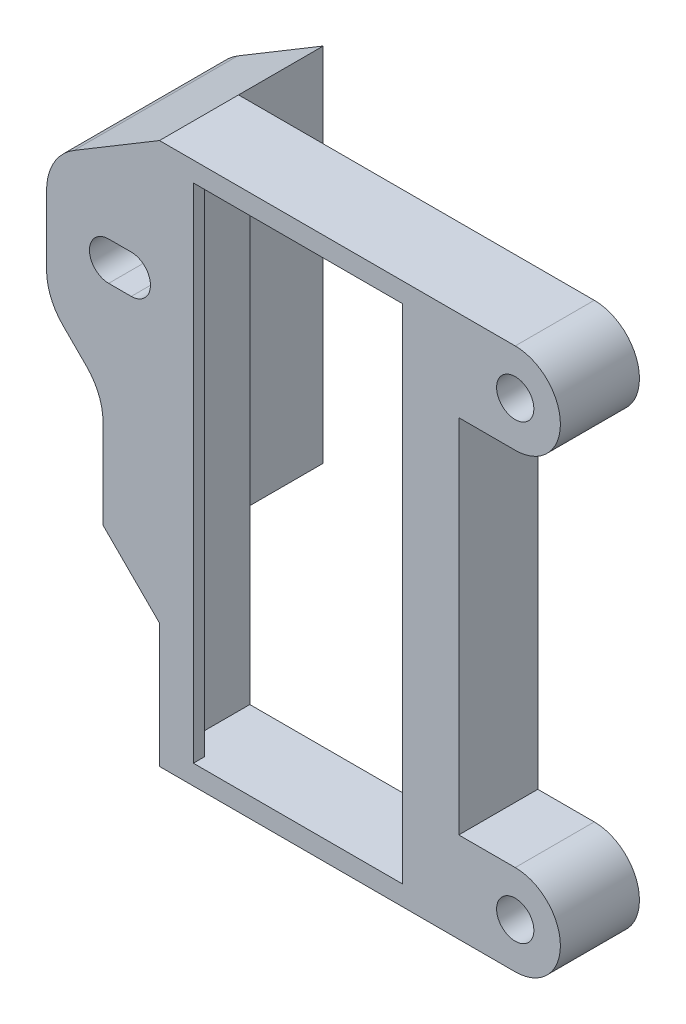
ISO-10303-21;
HEADER;
FILE_DESCRIPTION(('STEP AP214'),'2;1');
FILE_NAME('part.step','',(''),(''),'','','');
FILE_SCHEMA(('AUTOMOTIVE_DESIGN { 1 0 10303 214 1 1 1 1 }'));
ENDSEC;
DATA;
#1=APPLICATION_CONTEXT('core data for automotive mechanical design processes');
#2=APPLICATION_PROTOCOL_DEFINITION('international standard','automotive_design',2000,#1);
#3=PRODUCT_CONTEXT('',#1,'mechanical');
#4=PRODUCT('Part','Part','',(#3));
#5=PRODUCT_RELATED_PRODUCT_CATEGORY('part','',(#4));
#6=PRODUCT_DEFINITION_FORMATION('','',#4);
#7=PRODUCT_DEFINITION_CONTEXT('part definition',#1,'design');
#8=PRODUCT_DEFINITION('design','',#6,#7);
#9=PRODUCT_DEFINITION_SHAPE('','',#8);
#10=(LENGTH_UNIT() NAMED_UNIT(*) SI_UNIT(.MILLI.,.METRE.));
#11=(NAMED_UNIT(*) PLANE_ANGLE_UNIT() SI_UNIT($,.RADIAN.));
#12=(NAMED_UNIT(*) SI_UNIT($,.STERADIAN.) SOLID_ANGLE_UNIT());
#13=UNCERTAINTY_MEASURE_WITH_UNIT(LENGTH_MEASURE(1.E-05),#10,'distance_accuracy_value','');
#14=(GEOMETRIC_REPRESENTATION_CONTEXT(3) GLOBAL_UNCERTAINTY_ASSIGNED_CONTEXT((#13)) GLOBAL_UNIT_ASSIGNED_CONTEXT((#10,
#11,#12)) REPRESENTATION_CONTEXT('',''));
#15=CARTESIAN_POINT('',(0.,0.,0.));
#16=DIRECTION('',(0.,0.,1.));
#17=DIRECTION('',(1.,0.,0.));
#18=AXIS2_PLACEMENT_3D('',#15,#16,#17);
#19=CARTESIAN_POINT('',(-12.25,24.,1.));
#20=DIRECTION('',(1.,0.,0.));
#21=DIRECTION('',(0.,0.,-1.));
#22=AXIS2_PLACEMENT_3D('',#19,#20,#21);
#23=PLANE('',#22);
#24=DIRECTION('',(0.,-1.,0.));
#25=VECTOR('',#24,1.);
#26=CARTESIAN_POINT('',(-12.25,24.,1.));
#27=LINE('',#26,#25);
#28=CARTESIAN_POINT('',(-12.25,-13.,1.));
#29=VERTEX_POINT('',#28);
#30=CARTESIAN_POINT('',(-12.25,-24.,1.));
#31=VERTEX_POINT('',#30);
#32=EDGE_CURVE('E436',#29,#31,#27,.T.);
#33=ORIENTED_EDGE('',*,*,#32,.F.);
#34=DIRECTION('',(0.,0.,-1.));
#35=VECTOR('',#34,1.);
#36=CARTESIAN_POINT('',(-12.25,-13.,1.));
#37=LINE('',#36,#35);
#38=CARTESIAN_POINT('',(-12.25,-13.,-6.));
#39=VERTEX_POINT('',#38);
#40=EDGE_CURVE('E480',#29,#39,#37,.T.);
#41=ORIENTED_EDGE('',*,*,#40,.T.);
#42=DIRECTION('',(0.,-1.,0.));
#43=VECTOR('',#42,1.);
#44=CARTESIAN_POINT('',(-12.25,24.,-6.));
#45=LINE('',#44,#43);
#46=CARTESIAN_POINT('',(-12.25,-24.,-6.));
#47=VERTEX_POINT('',#46);
#48=EDGE_CURVE('E352',#39,#47,#45,.T.);
#49=ORIENTED_EDGE('',*,*,#48,.T.);
#50=DIRECTION('',(0.,0.,-1.));
#51=VECTOR('',#50,1.);
#52=CARTESIAN_POINT('',(-12.25,-24.,1.));
#53=LINE('',#52,#51);
#54=EDGE_CURVE('E440',#31,#47,#53,.T.);
#55=ORIENTED_EDGE('',*,*,#54,.F.);
#56=EDGE_LOOP('',(#33,#41,#49,#55));
#57=FACE_BOUND('',#56,.T.);
#58=ADVANCED_FACE('F37',(#57),#23,.F.);
#59=CARTESIAN_POINT('',(0.,0.,0.));
#60=DIRECTION('',(0.,0.,1.));
#61=DIRECTION('',(1.,0.,0.));
#62=AXIS2_PLACEMENT_3D('',#59,#60,#61);
#63=PLANE('',#62);
#64=DIRECTION('',(-1.,0.,0.));
#65=VECTOR('',#64,1.);
#66=CARTESIAN_POINT('',(0.,22.25,0.));
#67=LINE('',#66,#65);
#68=CARTESIAN_POINT('',(-9.25,22.25,0.));
#69=VERTEX_POINT('',#68);
#70=CARTESIAN_POINT('',(-11.25,22.25,0.));
#71=VERTEX_POINT('',#70);
#72=EDGE_CURVE('E405',#69,#71,#67,.T.);
#73=ORIENTED_EDGE('',*,*,#72,.F.);
#74=DIRECTION('',(0.,-1.,0.));
#75=VECTOR('',#74,1.);
#76=CARTESIAN_POINT('',(-9.25,22.25,0.));
#77=LINE('',#76,#75);
#78=CARTESIAN_POINT('',(-9.25,-22.25,0.));
#79=VERTEX_POINT('',#78);
#80=EDGE_CURVE('E412',#69,#79,#77,.T.);
#81=ORIENTED_EDGE('',*,*,#80,.T.);
#82=DIRECTION('',(1.,0.,0.));
#83=VECTOR('',#82,1.);
#84=CARTESIAN_POINT('',(0.,-22.25,0.));
#85=LINE('',#84,#83);
#86=CARTESIAN_POINT('',(-11.25,-22.25,0.));
#87=VERTEX_POINT('',#86);
#88=EDGE_CURVE('E402',#87,#79,#85,.T.);
#89=ORIENTED_EDGE('',*,*,#88,.F.);
#90=DIRECTION('',(0.,-1.,0.));
#91=VECTOR('',#90,1.);
#92=CARTESIAN_POINT('',(-11.25,0.,0.));
#93=LINE('',#92,#91);
#94=EDGE_CURVE('E449',#71,#87,#93,.T.);
#95=ORIENTED_EDGE('',*,*,#94,.F.);
#96=EDGE_LOOP('',(#73,#81,#89,#95));
#97=FACE_BOUND('',#96,.T.);
#98=ADVANCED_FACE('F545',(#97),#63,.F.);
#99=CARTESIAN_POINT('',(11.25,22.25,0.));
#100=VERTEX_POINT('',#99);
#101=CARTESIAN_POINT('',(9.25,22.25,0.));
#102=VERTEX_POINT('',#101);
#103=EDGE_CURVE('E408',#100,#102,#67,.T.);
#104=ORIENTED_EDGE('',*,*,#103,.F.);
#105=DIRECTION('',(0.,1.,0.));
#106=VECTOR('',#105,1.);
#107=CARTESIAN_POINT('',(11.25,0.,0.));
#108=LINE('',#107,#106);
#109=CARTESIAN_POINT('',(11.25,-22.25,0.));
#110=VERTEX_POINT('',#109);
#111=EDGE_CURVE('E446',#110,#100,#108,.T.);
#112=ORIENTED_EDGE('',*,*,#111,.F.);
#113=CARTESIAN_POINT('',(9.25,-22.25,0.));
#114=VERTEX_POINT('',#113);
#115=EDGE_CURVE('E391',#114,#110,#85,.T.);
#116=ORIENTED_EDGE('',*,*,#115,.F.);
#117=DIRECTION('',(0.,1.,0.));
#118=VECTOR('',#117,1.);
#119=CARTESIAN_POINT('',(9.25,22.25,0.));
#120=LINE('',#119,#118);
#121=EDGE_CURVE('E420',#114,#102,#120,.T.);
#122=ORIENTED_EDGE('',*,*,#121,.T.);
#123=EDGE_LOOP('',(#104,#112,#116,#122));
#124=FACE_BOUND('',#123,.T.);
#125=ADVANCED_FACE('F550',(#124),#63,.F.);
#126=CARTESIAN_POINT('',(0.,0.,1.));
#127=DIRECTION('',(0.,0.,1.));
#128=DIRECTION('',(1.,0.,0.));
#129=AXIS2_PLACEMENT_3D('',#126,#127,#128);
#130=PLANE('',#129);
#131=DIRECTION('',(-1.,0.,0.));
#132=VECTOR('',#131,1.);
#133=CARTESIAN_POINT('',(-9.25,22.25,1.));
#134=LINE('',#133,#132);
#135=CARTESIAN_POINT('',(9.25,22.25,1.));
#136=VERTEX_POINT('',#135);
#137=CARTESIAN_POINT('',(-9.25,22.25,1.));
#138=VERTEX_POINT('',#137);
#139=EDGE_CURVE('E411',#136,#138,#134,.T.);
#140=ORIENTED_EDGE('',*,*,#139,.F.);
#141=DIRECTION('',(0.,1.,0.));
#142=VECTOR('',#141,1.);
#143=CARTESIAN_POINT('',(9.25,22.25,1.));
#144=LINE('',#143,#142);
#145=CARTESIAN_POINT('',(9.25,-22.25,1.));
#146=VERTEX_POINT('',#145);
#147=EDGE_CURVE('E409',#146,#136,#144,.T.);
#148=ORIENTED_EDGE('',*,*,#147,.F.);
#149=DIRECTION('',(1.,0.,0.));
#150=VECTOR('',#149,1.);
#151=CARTESIAN_POINT('',(-9.25,-22.25,1.));
#152=LINE('',#151,#150);
#153=CARTESIAN_POINT('',(-9.25,-22.25,1.));
#154=VERTEX_POINT('',#153);
#155=EDGE_CURVE('E417',#154,#146,#152,.T.);
#156=ORIENTED_EDGE('',*,*,#155,.F.);
#157=DIRECTION('',(0.,-1.,0.));
#158=VECTOR('',#157,1.);
#159=CARTESIAN_POINT('',(-9.25,22.25,1.));
#160=LINE('',#159,#158);
#161=EDGE_CURVE('E414',#138,#154,#160,.T.);
#162=ORIENTED_EDGE('',*,*,#161,.F.);
#163=EDGE_LOOP('',(#140,#148,#156,#162));
#164=FACE_BOUND('',#163,.T.);
#165=DIRECTION('',(-0.857492925712544,-0.514495755427527,0.));
#166=VECTOR('',#165,1.);
#167=CARTESIAN_POINT('',(-13.8308823529412,23.0514705882353,1.));
#168=LINE('',#167,#166);
#169=CARTESIAN_POINT('',(-12.25,24.,1.));
#170=VERTEX_POINT('',#169);
#171=CARTESIAN_POINT('',(-19.8224787771376,19.4565127337174,1.));
#172=VERTEX_POINT('',#171);
#173=EDGE_CURVE('E294',#170,#172,#168,.T.);
#174=ORIENTED_EDGE('',*,*,#173,.T.);
#175=CARTESIAN_POINT('',(-17.25,15.1690481051547,1.));
#176=DIRECTION('',(0.,0.,1.));
#177=DIRECTION('',(1.,0.,0.));
#178=AXIS2_PLACEMENT_3D('',#175,#176,#177);
#179=CIRCLE('',#178,5.);
#180=CARTESIAN_POINT('',(-22.25,15.1690481051547,1.));
#181=VERTEX_POINT('',#180);
#182=EDGE_CURVE('E464',#172,#181,#179,.T.);
#183=ORIENTED_EDGE('',*,*,#182,.T.);
#184=DIRECTION('',(0.,-1.,0.));
#185=VECTOR('',#184,1.);
#186=CARTESIAN_POINT('',(-22.25,0.,1.));
#187=LINE('',#186,#185);
#188=CARTESIAN_POINT('',(-22.25,9.07106781186548,1.));
#189=VERTEX_POINT('',#188);
#190=EDGE_CURVE('E263',#181,#189,#187,.T.);
#191=ORIENTED_EDGE('',*,*,#190,.T.);
#192=CARTESIAN_POINT('',(-17.25,9.07106781186548,1.));
#193=DIRECTION('',(0.,0.,1.));
#194=DIRECTION('',(1.,0.,0.));
#195=AXIS2_PLACEMENT_3D('',#192,#193,#194);
#196=CIRCLE('',#195,5.);
#197=CARTESIAN_POINT('',(-20.7855339059327,5.53553390593274,1.));
#198=VERTEX_POINT('',#197);
#199=EDGE_CURVE('E462',#189,#198,#196,.T.);
#200=ORIENTED_EDGE('',*,*,#199,.T.);
#201=DIRECTION('',(0.707106781186548,-0.707106781186547,0.));
#202=VECTOR('',#201,1.);
#203=CARTESIAN_POINT('',(-7.62499999999997,-7.62499999999999,1.));
#204=LINE('',#203,#202);
#205=CARTESIAN_POINT('',(-18.7144660940673,3.46446609406728,1.));
#206=VERTEX_POINT('',#205);
#207=EDGE_CURVE('E260',#198,#206,#204,.T.);
#208=ORIENTED_EDGE('',*,*,#207,.T.);
#209=CARTESIAN_POINT('',(-22.25,-0.0710678118654613,1.));
#210=DIRECTION('',(0.,0.,1.));
#211=DIRECTION('',(1.,0.,0.));
#212=AXIS2_PLACEMENT_3D('',#209,#210,#211);
#213=CIRCLE('',#212,5.);
#214=CARTESIAN_POINT('',(-17.25,-0.0710678118654613,1.));
#215=VERTEX_POINT('',#214);
#216=EDGE_CURVE('E475',#206,#215,#213,.F.);
#217=ORIENTED_EDGE('',*,*,#216,.T.);
#218=DIRECTION('',(0.,-1.,0.));
#219=VECTOR('',#218,1.);
#220=CARTESIAN_POINT('',(-17.25,0.,1.));
#221=LINE('',#220,#219);
#222=CARTESIAN_POINT('',(-17.25,-8.00000000000002,1.));
#223=VERTEX_POINT('',#222);
#224=EDGE_CURVE('E292',#215,#223,#221,.T.);
#225=ORIENTED_EDGE('',*,*,#224,.T.);
#226=DIRECTION('',(0.707106781186551,-0.707106781186544,0.));
#227=VECTOR('',#226,1.);
#228=CARTESIAN_POINT('',(-17.25,-8.00000000000002,1.));
#229=LINE('',#228,#227);
#230=EDGE_CURVE('E46',#223,#29,#229,.T.);
#231=ORIENTED_EDGE('',*,*,#230,.T.);
#232=ORIENTED_EDGE('',*,*,#32,.T.);
#233=DIRECTION('',(1.,0.,0.));
#234=VECTOR('',#233,1.);
#235=CARTESIAN_POINT('',(-12.25,-24.,1.));
#236=LINE('',#235,#234);
#237=CARTESIAN_POINT('',(19.25,-24.,1.));
#238=VERTEX_POINT('',#237);
#239=EDGE_CURVE('E438',#31,#238,#236,.T.);
#240=ORIENTED_EDGE('',*,*,#239,.T.);
#241=CARTESIAN_POINT('',(19.25,-20.,1.));
#242=DIRECTION('',(0.,0.,1.));
#243=DIRECTION('',(-1.,0.,0.));
#244=AXIS2_PLACEMENT_3D('',#241,#242,#243);
#245=CIRCLE('',#244,4.);
#246=CARTESIAN_POINT('',(19.25,-16.,1.));
#247=VERTEX_POINT('',#246);
#248=EDGE_CURVE('E340',#238,#247,#245,.T.);
#249=ORIENTED_EDGE('',*,*,#248,.T.);
#250=DIRECTION('',(-1.,0.,0.));
#251=VECTOR('',#250,1.);
#252=CARTESIAN_POINT('',(14.25,-16.,1.));
#253=LINE('',#252,#251);
#254=CARTESIAN_POINT('',(14.25,-16.,1.));
#255=VERTEX_POINT('',#254);
#256=EDGE_CURVE('E377',#247,#255,#253,.T.);
#257=ORIENTED_EDGE('',*,*,#256,.T.);
#258=DIRECTION('',(0.,1.,0.));
#259=VECTOR('',#258,1.);
#260=CARTESIAN_POINT('',(14.25,16.,1.));
#261=LINE('',#260,#259);
#262=CARTESIAN_POINT('',(14.25,16.,1.));
#263=VERTEX_POINT('',#262);
#264=EDGE_CURVE('E380',#255,#263,#261,.T.);
#265=ORIENTED_EDGE('',*,*,#264,.T.);
#266=DIRECTION('',(1.,0.,0.));
#267=VECTOR('',#266,1.);
#268=CARTESIAN_POINT('',(19.25,16.,1.));
#269=LINE('',#268,#267);
#270=CARTESIAN_POINT('',(19.25,16.,1.));
#271=VERTEX_POINT('',#270);
#272=EDGE_CURVE('E383',#263,#271,#269,.T.);
#273=ORIENTED_EDGE('',*,*,#272,.T.);
#274=CARTESIAN_POINT('',(19.25,20.,1.));
#275=DIRECTION('',(0.,0.,1.));
#276=DIRECTION('',(-1.,0.,0.));
#277=AXIS2_PLACEMENT_3D('',#274,#275,#276);
#278=CIRCLE('',#277,4.);
#279=CARTESIAN_POINT('',(19.25,24.,1.));
#280=VERTEX_POINT('',#279);
#281=EDGE_CURVE('E353',#271,#280,#278,.T.);
#282=ORIENTED_EDGE('',*,*,#281,.T.);
#283=DIRECTION('',(-1.,0.,0.));
#284=VECTOR('',#283,1.);
#285=CARTESIAN_POINT('',(-12.25,24.,1.));
#286=LINE('',#285,#284);
#287=EDGE_CURVE('E434',#280,#170,#286,.T.);
#288=ORIENTED_EDGE('',*,*,#287,.T.);
#289=EDGE_LOOP('',(#174,#183,#191,#200,#208,#217,#225,#231,#232,#240,#249,#257,#265,#273,#282,#288));
#290=FACE_BOUND('',#289,.T.);
#291=CARTESIAN_POINT('',(19.25,-20.,1.));
#292=DIRECTION('',(0.,0.,1.));
#293=DIRECTION('',(1.,0.,0.));
#294=AXIS2_PLACEMENT_3D('',#291,#292,#293);
#295=CIRCLE('',#294,1.65);
#296=CARTESIAN_POINT('',(20.9,-20.,1.));
#297=VERTEX_POINT('',#296);
#298=EDGE_CURVE('E316',#297,#297,#295,.T.);
#299=ORIENTED_EDGE('',*,*,#298,.F.);
#300=EDGE_LOOP('',(#299));
#301=FACE_BOUND('',#300,.T.);
#302=CARTESIAN_POINT('',(19.25,20.,1.));
#303=DIRECTION('',(0.,0.,1.));
#304=DIRECTION('',(1.,0.,0.));
#305=AXIS2_PLACEMENT_3D('',#302,#303,#304);
#306=CIRCLE('',#305,1.65);
#307=CARTESIAN_POINT('',(20.9,20.,1.));
#308=VERTEX_POINT('',#307);
#309=EDGE_CURVE('E302',#308,#308,#306,.T.);
#310=ORIENTED_EDGE('',*,*,#309,.F.);
#311=EDGE_LOOP('',(#310));
#312=FACE_BOUND('',#311,.T.);
#313=CARTESIAN_POINT('',(-14.75,12.5,1.));
#314=DIRECTION('',(0.,0.,1.));
#315=DIRECTION('',(1.,0.,0.));
#316=AXIS2_PLACEMENT_3D('',#313,#314,#315);
#317=CIRCLE('',#316,1.7);
#318=CARTESIAN_POINT('',(-14.75,10.8,1.));
#319=VERTEX_POINT('',#318);
#320=CARTESIAN_POINT('',(-14.75,14.2,1.));
#321=VERTEX_POINT('',#320);
#322=EDGE_CURVE('E284',#319,#321,#317,.T.);
#323=ORIENTED_EDGE('',*,*,#322,.F.);
#324=DIRECTION('',(1.,0.,0.));
#325=VECTOR('',#324,1.);
#326=CARTESIAN_POINT('',(0.,10.8,1.));
#327=LINE('',#326,#325);
#328=CARTESIAN_POINT('',(-16.75,10.8,1.));
#329=VERTEX_POINT('',#328);
#330=EDGE_CURVE('E250',#329,#319,#327,.T.);
#331=ORIENTED_EDGE('',*,*,#330,.F.);
#332=CARTESIAN_POINT('',(-16.75,12.5,1.));
#333=DIRECTION('',(0.,0.,1.));
#334=DIRECTION('',(1.,0.,0.));
#335=AXIS2_PLACEMENT_3D('',#332,#333,#334);
#336=CIRCLE('',#335,1.7);
#337=CARTESIAN_POINT('',(-16.75,14.2,1.));
#338=VERTEX_POINT('',#337);
#339=EDGE_CURVE('E287',#338,#329,#336,.T.);
#340=ORIENTED_EDGE('',*,*,#339,.F.);
#341=DIRECTION('',(1.,0.,0.));
#342=VECTOR('',#341,1.);
#343=CARTESIAN_POINT('',(0.,14.2,1.));
#344=LINE('',#343,#342);
#345=EDGE_CURVE('E289',#338,#321,#344,.T.);
#346=ORIENTED_EDGE('',*,*,#345,.T.);
#347=EDGE_LOOP('',(#323,#331,#340,#346));
#348=FACE_BOUND('',#347,.T.);
#349=ADVANCED_FACE('F497',(#164,#290,#301,#312,#348),#130,.T.);
#350=CARTESIAN_POINT('',(-12.25,24.,1.));
#351=DIRECTION('',(0.,-1.,0.));
#352=DIRECTION('',(0.,0.,-1.));
#353=AXIS2_PLACEMENT_3D('',#350,#351,#352);
#354=PLANE('',#353);
#355=DIRECTION('',(-1.,0.,0.));
#356=VECTOR('',#355,1.);
#357=CARTESIAN_POINT('',(-12.25,24.,-6.));
#358=LINE('',#357,#356);
#359=CARTESIAN_POINT('',(19.25,24.,-6.));
#360=VERTEX_POINT('',#359);
#361=CARTESIAN_POINT('',(-12.25,24.,-6.));
#362=VERTEX_POINT('',#361);
#363=EDGE_CURVE('E349',#360,#362,#358,.T.);
#364=ORIENTED_EDGE('',*,*,#363,.T.);
#365=DIRECTION('',(0.,0.,-1.));
#366=VECTOR('',#365,1.);
#367=CARTESIAN_POINT('',(-12.25,24.,1.));
#368=LINE('',#367,#366);
#369=EDGE_CURVE('E443',#170,#362,#368,.T.);
#370=ORIENTED_EDGE('',*,*,#369,.F.);
#371=ORIENTED_EDGE('',*,*,#287,.F.);
#372=DIRECTION('',(0.,0.,1.));
#373=VECTOR('',#372,1.);
#374=CARTESIAN_POINT('',(19.25,24.,-6.));
#375=LINE('',#374,#373);
#376=EDGE_CURVE('E388',#360,#280,#375,.T.);
#377=ORIENTED_EDGE('',*,*,#376,.F.);
#378=EDGE_LOOP('',(#364,#370,#371,#377));
#379=FACE_BOUND('',#378,.T.);
#380=ADVANCED_FACE('F556',(#379),#354,.F.);
#381=CARTESIAN_POINT('',(-12.25,-24.,1.));
#382=DIRECTION('',(0.,1.,0.));
#383=DIRECTION('',(0.,0.,1.));
#384=AXIS2_PLACEMENT_3D('',#381,#382,#383);
#385=PLANE('',#384);
#386=ORIENTED_EDGE('',*,*,#54,.T.);
#387=DIRECTION('',(1.,0.,0.));
#388=VECTOR('',#387,1.);
#389=CARTESIAN_POINT('',(-12.25,-24.,-6.));
#390=LINE('',#389,#388);
#391=CARTESIAN_POINT('',(19.25,-24.,-6.));
#392=VERTEX_POINT('',#391);
#393=EDGE_CURVE('E357',#47,#392,#390,.T.);
#394=ORIENTED_EDGE('',*,*,#393,.T.);
#395=DIRECTION('',(0.,0.,1.));
#396=VECTOR('',#395,1.);
#397=CARTESIAN_POINT('',(19.25,-24.,-6.));
#398=LINE('',#397,#396);
#399=EDGE_CURVE('E374',#392,#238,#398,.T.);
#400=ORIENTED_EDGE('',*,*,#399,.T.);
#401=ORIENTED_EDGE('',*,*,#239,.F.);
#402=EDGE_LOOP('',(#386,#394,#400,#401));
#403=FACE_BOUND('',#402,.T.);
#404=ADVANCED_FACE('F555',(#403),#385,.F.);
#405=CARTESIAN_POINT('',(9.25,22.25,1.));
#406=DIRECTION('',(-1.,0.,0.));
#407=DIRECTION('',(0.,-1.,0.));
#408=AXIS2_PLACEMENT_3D('',#405,#406,#407);
#409=PLANE('',#408);
#410=ORIENTED_EDGE('',*,*,#121,.F.);
#411=DIRECTION('',(0.,0.,-1.));
#412=VECTOR('',#411,1.);
#413=CARTESIAN_POINT('',(9.25,-22.25,1.));
#414=LINE('',#413,#412);
#415=EDGE_CURVE('E419',#146,#114,#414,.T.);
#416=ORIENTED_EDGE('',*,*,#415,.F.);
#417=ORIENTED_EDGE('',*,*,#147,.T.);
#418=DIRECTION('',(0.,0.,-1.));
#419=VECTOR('',#418,1.);
#420=CARTESIAN_POINT('',(9.25,22.25,1.));
#421=LINE('',#420,#419);
#422=EDGE_CURVE('E432',#136,#102,#421,.T.);
#423=ORIENTED_EDGE('',*,*,#422,.T.);
#424=EDGE_LOOP('',(#410,#416,#417,#423));
#425=FACE_BOUND('',#424,.T.);
#426=ADVANCED_FACE('F823',(#425),#409,.T.);
#427=CARTESIAN_POINT('',(-9.25,22.25,1.));
#428=DIRECTION('',(0.,-1.,0.));
#429=DIRECTION('',(0.,0.,-1.));
#430=AXIS2_PLACEMENT_3D('',#427,#428,#429);
#431=PLANE('',#430);
#432=DIRECTION('',(0.,0.,-1.));
#433=VECTOR('',#432,1.);
#434=CARTESIAN_POINT('',(-9.25,22.25,1.));
#435=LINE('',#434,#433);
#436=EDGE_CURVE('E429',#138,#69,#435,.T.);
#437=ORIENTED_EDGE('',*,*,#436,.T.);
#438=ORIENTED_EDGE('',*,*,#72,.T.);
#439=DIRECTION('',(0.,0.,1.));
#440=VECTOR('',#439,1.);
#441=CARTESIAN_POINT('',(-11.25,22.25,-6.));
#442=LINE('',#441,#440);
#443=CARTESIAN_POINT('',(-11.25,22.25,-6.));
#444=VERTEX_POINT('',#443);
#445=EDGE_CURVE('E337',#444,#71,#442,.T.);
#446=ORIENTED_EDGE('',*,*,#445,.F.);
#447=DIRECTION('',(-1.,0.,0.));
#448=VECTOR('',#447,1.);
#449=CARTESIAN_POINT('',(-11.25,22.25,-6.));
#450=LINE('',#449,#448);
#451=CARTESIAN_POINT('',(11.25,22.25,-6.));
#452=VERTEX_POINT('',#451);
#453=EDGE_CURVE('E333',#452,#444,#450,.T.);
#454=ORIENTED_EDGE('',*,*,#453,.F.);
#455=DIRECTION('',(0.,0.,1.));
#456=VECTOR('',#455,1.);
#457=CARTESIAN_POINT('',(11.25,22.25,-6.));
#458=LINE('',#457,#456);
#459=EDGE_CURVE('E341',#452,#100,#458,.T.);
#460=ORIENTED_EDGE('',*,*,#459,.T.);
#461=ORIENTED_EDGE('',*,*,#103,.T.);
#462=ORIENTED_EDGE('',*,*,#422,.F.);
#463=ORIENTED_EDGE('',*,*,#139,.T.);
#464=EDGE_LOOP('',(#437,#438,#446,#454,#460,#461,#462,#463));
#465=FACE_BOUND('',#464,.T.);
#466=ADVANCED_FACE('F813',(#465),#431,.T.);
#467=CARTESIAN_POINT('',(-9.25,22.25,1.));
#468=DIRECTION('',(1.,0.,0.));
#469=DIRECTION('',(0.,1.,0.));
#470=AXIS2_PLACEMENT_3D('',#467,#468,#469);
#471=PLANE('',#470);
#472=ORIENTED_EDGE('',*,*,#80,.F.);
#473=ORIENTED_EDGE('',*,*,#436,.F.);
#474=ORIENTED_EDGE('',*,*,#161,.T.);
#475=DIRECTION('',(0.,0.,-1.));
#476=VECTOR('',#475,1.);
#477=CARTESIAN_POINT('',(-9.25,-22.25,1.));
#478=LINE('',#477,#476);
#479=EDGE_CURVE('E427',#154,#79,#478,.T.);
#480=ORIENTED_EDGE('',*,*,#479,.T.);
#481=EDGE_LOOP('',(#472,#473,#474,#480));
#482=FACE_BOUND('',#481,.T.);
#483=ADVANCED_FACE('F801',(#482),#471,.T.);
#484=CARTESIAN_POINT('',(-9.25,-22.25,1.));
#485=DIRECTION('',(0.,1.,0.));
#486=DIRECTION('',(0.,0.,1.));
#487=AXIS2_PLACEMENT_3D('',#484,#485,#486);
#488=PLANE('',#487);
#489=ORIENTED_EDGE('',*,*,#415,.T.);
#490=ORIENTED_EDGE('',*,*,#115,.T.);
#491=DIRECTION('',(0.,0.,1.));
#492=VECTOR('',#491,1.);
#493=CARTESIAN_POINT('',(11.25,-22.25,-6.));
#494=LINE('',#493,#492);
#495=CARTESIAN_POINT('',(11.25,-22.25,-6.));
#496=VERTEX_POINT('',#495);
#497=EDGE_CURVE('E344',#496,#110,#494,.T.);
#498=ORIENTED_EDGE('',*,*,#497,.F.);
#499=DIRECTION('',(1.,0.,0.));
#500=VECTOR('',#499,1.);
#501=CARTESIAN_POINT('',(11.25,-22.25,-6.));
#502=LINE('',#501,#500);
#503=CARTESIAN_POINT('',(-11.25,-22.25,-6.));
#504=VERTEX_POINT('',#503);
#505=EDGE_CURVE('E327',#504,#496,#502,.T.);
#506=ORIENTED_EDGE('',*,*,#505,.F.);
#507=DIRECTION('',(0.,0.,1.));
#508=VECTOR('',#507,1.);
#509=CARTESIAN_POINT('',(-11.25,-22.25,-6.));
#510=LINE('',#509,#508);
#511=EDGE_CURVE('E336',#504,#87,#510,.T.);
#512=ORIENTED_EDGE('',*,*,#511,.T.);
#513=ORIENTED_EDGE('',*,*,#88,.T.);
#514=ORIENTED_EDGE('',*,*,#479,.F.);
#515=ORIENTED_EDGE('',*,*,#155,.T.);
#516=EDGE_LOOP('',(#489,#490,#498,#506,#512,#513,#514,#515));
#517=FACE_BOUND('',#516,.T.);
#518=ADVANCED_FACE('F791',(#517),#488,.T.);
#519=CARTESIAN_POINT('',(-11.25,-22.25,-6.));
#520=DIRECTION('',(-1.,0.,0.));
#521=DIRECTION('',(0.,0.,1.));
#522=AXIS2_PLACEMENT_3D('',#519,#520,#521);
#523=PLANE('',#522);
#524=ORIENTED_EDGE('',*,*,#445,.T.);
#525=ORIENTED_EDGE('',*,*,#94,.T.);
#526=ORIENTED_EDGE('',*,*,#511,.F.);
#527=DIRECTION('',(0.,-1.,0.));
#528=VECTOR('',#527,1.);
#529=CARTESIAN_POINT('',(-11.25,-22.25,-6.));
#530=LINE('',#529,#528);
#531=EDGE_CURVE('E322',#444,#504,#530,.T.);
#532=ORIENTED_EDGE('',*,*,#531,.F.);
#533=EDGE_LOOP('',(#524,#525,#526,#532));
#534=FACE_BOUND('',#533,.T.);
#535=ADVANCED_FACE('F781',(#534),#523,.F.);
#536=CARTESIAN_POINT('',(11.25,22.25,-6.));
#537=DIRECTION('',(1.,0.,0.));
#538=DIRECTION('',(0.,1.,0.));
#539=AXIS2_PLACEMENT_3D('',#536,#537,#538);
#540=PLANE('',#539);
#541=ORIENTED_EDGE('',*,*,#497,.T.);
#542=ORIENTED_EDGE('',*,*,#111,.T.);
#543=ORIENTED_EDGE('',*,*,#459,.F.);
#544=DIRECTION('',(0.,1.,0.));
#545=VECTOR('',#544,1.);
#546=CARTESIAN_POINT('',(11.25,22.25,-6.));
#547=LINE('',#546,#545);
#548=EDGE_CURVE('E330',#496,#452,#547,.T.);
#549=ORIENTED_EDGE('',*,*,#548,.F.);
#550=EDGE_LOOP('',(#541,#542,#543,#549));
#551=FACE_BOUND('',#550,.T.);
#552=ADVANCED_FACE('F771',(#551),#540,.F.);
#553=CARTESIAN_POINT('',(19.25,20.,-6.));
#554=DIRECTION('',(0.,0.,1.));
#555=DIRECTION('',(1.,0.,0.));
#556=AXIS2_PLACEMENT_3D('',#553,#554,#555);
#557=CYLINDRICAL_SURFACE('',#556,4.);
#558=ORIENTED_EDGE('',*,*,#281,.F.);
#559=DIRECTION('',(0.,0.,1.));
#560=VECTOR('',#559,1.);
#561=CARTESIAN_POINT('',(19.25,16.,-6.));
#562=LINE('',#561,#560);
#563=CARTESIAN_POINT('',(19.25,16.,-6.));
#564=VERTEX_POINT('',#563);
#565=EDGE_CURVE('E392',#564,#271,#562,.T.);
#566=ORIENTED_EDGE('',*,*,#565,.F.);
#567=CARTESIAN_POINT('',(19.25,20.,-6.));
#568=DIRECTION('',(0.,0.,1.));
#569=DIRECTION('',(-1.,0.,0.));
#570=AXIS2_PLACEMENT_3D('',#567,#568,#569);
#571=CIRCLE('',#570,4.);
#572=EDGE_CURVE('E371',#564,#360,#571,.T.);
#573=ORIENTED_EDGE('',*,*,#572,.T.);
#574=ORIENTED_EDGE('',*,*,#376,.T.);
#575=EDGE_LOOP('',(#558,#566,#573,#574));
#576=FACE_BOUND('',#575,.T.);
#577=ADVANCED_FACE('F761',(#576),#557,.T.);
#578=CARTESIAN_POINT('',(19.25,16.,-6.));
#579=DIRECTION('',(0.,-1.,0.));
#580=DIRECTION('',(0.,0.,-1.));
#581=AXIS2_PLACEMENT_3D('',#578,#579,#580);
#582=PLANE('',#581);
#583=ORIENTED_EDGE('',*,*,#272,.F.);
#584=DIRECTION('',(0.,0.,1.));
#585=VECTOR('',#584,1.);
#586=CARTESIAN_POINT('',(14.25,16.,-6.));
#587=LINE('',#586,#585);
#588=CARTESIAN_POINT('',(14.25,16.,-6.));
#589=VERTEX_POINT('',#588);
#590=EDGE_CURVE('E394',#589,#263,#587,.T.);
#591=ORIENTED_EDGE('',*,*,#590,.F.);
#592=DIRECTION('',(1.,0.,0.));
#593=VECTOR('',#592,1.);
#594=CARTESIAN_POINT('',(19.25,16.,-6.));
#595=LINE('',#594,#593);
#596=EDGE_CURVE('E368',#589,#564,#595,.T.);
#597=ORIENTED_EDGE('',*,*,#596,.T.);
#598=ORIENTED_EDGE('',*,*,#565,.T.);
#599=EDGE_LOOP('',(#583,#591,#597,#598));
#600=FACE_BOUND('',#599,.T.);
#601=ADVANCED_FACE('F751',(#600),#582,.T.);
#602=CARTESIAN_POINT('',(14.25,16.,-6.));
#603=DIRECTION('',(1.,0.,0.));
#604=DIRECTION('',(0.,0.,-1.));
#605=AXIS2_PLACEMENT_3D('',#602,#603,#604);
#606=PLANE('',#605);
#607=ORIENTED_EDGE('',*,*,#264,.F.);
#608=DIRECTION('',(0.,0.,1.));
#609=VECTOR('',#608,1.);
#610=CARTESIAN_POINT('',(14.25,-16.,-6.));
#611=LINE('',#610,#609);
#612=CARTESIAN_POINT('',(14.25,-16.,-6.));
#613=VERTEX_POINT('',#612);
#614=EDGE_CURVE('E396',#613,#255,#611,.T.);
#615=ORIENTED_EDGE('',*,*,#614,.F.);
#616=DIRECTION('',(0.,1.,0.));
#617=VECTOR('',#616,1.);
#618=CARTESIAN_POINT('',(14.25,16.,-6.));
#619=LINE('',#618,#617);
#620=EDGE_CURVE('E365',#613,#589,#619,.T.);
#621=ORIENTED_EDGE('',*,*,#620,.T.);
#622=ORIENTED_EDGE('',*,*,#590,.T.);
#623=EDGE_LOOP('',(#607,#615,#621,#622));
#624=FACE_BOUND('',#623,.T.);
#625=ADVANCED_FACE('F741',(#624),#606,.T.);
#626=CARTESIAN_POINT('',(14.25,-16.,-6.));
#627=DIRECTION('',(0.,1.,0.));
#628=DIRECTION('',(-1.,0.,0.));
#629=AXIS2_PLACEMENT_3D('',#626,#627,#628);
#630=PLANE('',#629);
#631=ORIENTED_EDGE('',*,*,#256,.F.);
#632=DIRECTION('',(0.,0.,1.));
#633=VECTOR('',#632,1.);
#634=CARTESIAN_POINT('',(19.25,-16.,-6.));
#635=LINE('',#634,#633);
#636=CARTESIAN_POINT('',(19.25,-16.,-6.));
#637=VERTEX_POINT('',#636);
#638=EDGE_CURVE('E398',#637,#247,#635,.T.);
#639=ORIENTED_EDGE('',*,*,#638,.F.);
#640=DIRECTION('',(-1.,0.,0.));
#641=VECTOR('',#640,1.);
#642=CARTESIAN_POINT('',(14.25,-16.,-6.));
#643=LINE('',#642,#641);
#644=EDGE_CURVE('E362',#637,#613,#643,.T.);
#645=ORIENTED_EDGE('',*,*,#644,.T.);
#646=ORIENTED_EDGE('',*,*,#614,.T.);
#647=EDGE_LOOP('',(#631,#639,#645,#646));
#648=FACE_BOUND('',#647,.T.);
#649=ADVANCED_FACE('F731',(#648),#630,.T.);
#650=CARTESIAN_POINT('',(19.25,-20.,-6.));
#651=DIRECTION('',(0.,0.,1.));
#652=DIRECTION('',(1.,0.,0.));
#653=AXIS2_PLACEMENT_3D('',#650,#651,#652);
#654=CYLINDRICAL_SURFACE('',#653,4.);
#655=ORIENTED_EDGE('',*,*,#248,.F.);
#656=ORIENTED_EDGE('',*,*,#399,.F.);
#657=CARTESIAN_POINT('',(19.25,-20.,-6.));
#658=DIRECTION('',(0.,0.,1.));
#659=DIRECTION('',(-1.,0.,0.));
#660=AXIS2_PLACEMENT_3D('',#657,#658,#659);
#661=CIRCLE('',#660,4.);
#662=EDGE_CURVE('E359',#392,#637,#661,.T.);
#663=ORIENTED_EDGE('',*,*,#662,.T.);
#664=ORIENTED_EDGE('',*,*,#638,.T.);
#665=EDGE_LOOP('',(#655,#656,#663,#664));
#666=FACE_BOUND('',#665,.T.);
#667=ADVANCED_FACE('F597',(#666),#654,.T.);
#668=CARTESIAN_POINT('',(19.25,20.,-6.));
#669=DIRECTION('',(0.,0.,-1.));
#670=DIRECTION('',(-1.,0.,0.));
#671=AXIS2_PLACEMENT_3D('',#668,#669,#670);
#672=PLANE('',#671);
#673=CARTESIAN_POINT('',(19.25,20.,-6.));
#674=DIRECTION('',(0.,0.,1.));
#675=DIRECTION('',(1.,0.,0.));
#676=AXIS2_PLACEMENT_3D('',#673,#674,#675);
#677=CIRCLE('',#676,1.65);
#678=CARTESIAN_POINT('',(20.9,20.,-6.));
#679=VERTEX_POINT('',#678);
#680=EDGE_CURVE('E313',#679,#679,#677,.T.);
#681=ORIENTED_EDGE('',*,*,#680,.T.);
#682=EDGE_LOOP('',(#681));
#683=FACE_BOUND('',#682,.T.);
#684=CARTESIAN_POINT('',(19.25,-20.,-6.));
#685=DIRECTION('',(0.,0.,1.));
#686=DIRECTION('',(1.,0.,0.));
#687=AXIS2_PLACEMENT_3D('',#684,#685,#686);
#688=CIRCLE('',#687,1.65);
#689=CARTESIAN_POINT('',(20.9,-20.,-6.));
#690=VERTEX_POINT('',#689);
#691=EDGE_CURVE('E319',#690,#690,#688,.T.);
#692=ORIENTED_EDGE('',*,*,#691,.T.);
#693=EDGE_LOOP('',(#692));
#694=FACE_BOUND('',#693,.T.);
#695=ORIENTED_EDGE('',*,*,#531,.T.);
#696=ORIENTED_EDGE('',*,*,#505,.T.);
#697=ORIENTED_EDGE('',*,*,#548,.T.);
#698=ORIENTED_EDGE('',*,*,#453,.T.);
#699=EDGE_LOOP('',(#695,#696,#697,#698));
#700=FACE_BOUND('',#699,.T.);
#701=ORIENTED_EDGE('',*,*,#363,.F.);
#702=ORIENTED_EDGE('',*,*,#572,.F.);
#703=ORIENTED_EDGE('',*,*,#596,.F.);
#704=ORIENTED_EDGE('',*,*,#620,.F.);
#705=ORIENTED_EDGE('',*,*,#644,.F.);
#706=ORIENTED_EDGE('',*,*,#662,.F.);
#707=ORIENTED_EDGE('',*,*,#393,.F.);
#708=ORIENTED_EDGE('',*,*,#48,.F.);
#709=DIRECTION('',(-0.707106781186551,0.707106781186544,0.));
#710=VECTOR('',#709,1.);
#711=CARTESIAN_POINT('',(-17.25,-8.00000000000002,-6.));
#712=LINE('',#711,#710);
#713=CARTESIAN_POINT('',(-17.25,-8.00000000000002,-6.));
#714=VERTEX_POINT('',#713);
#715=EDGE_CURVE('E11',#39,#714,#712,.T.);
#716=ORIENTED_EDGE('',*,*,#715,.T.);
#717=DIRECTION('',(-1.,0.,0.));
#718=VECTOR('',#717,1.);
#719=CARTESIAN_POINT('',(19.25,-8.00000000000003,-6.));
#720=LINE('',#719,#718);
#721=CARTESIAN_POINT('',(-12.25,-8.00000000000002,-6.));
#722=VERTEX_POINT('',#721);
#723=EDGE_CURVE('E52',#722,#714,#720,.T.);
#724=ORIENTED_EDGE('',*,*,#723,.F.);
#725=EDGE_CURVE('E354',#362,#722,#45,.T.);
#726=ORIENTED_EDGE('',*,*,#725,.F.);
#727=EDGE_LOOP('',(#701,#702,#703,#704,#705,#706,#707,#708,#716,#724,#726));
#728=FACE_BOUND('',#727,.T.);
#729=ADVANCED_FACE('F488',(#683,#694,#700,#728),#672,.T.);
#730=CARTESIAN_POINT('',(19.25,-20.,-6.));
#731=DIRECTION('',(0.,0.,1.));
#732=DIRECTION('',(1.,0.,0.));
#733=AXIS2_PLACEMENT_3D('',#730,#731,#732);
#734=CYLINDRICAL_SURFACE('',#733,1.65);
#735=ORIENTED_EDGE('',*,*,#691,.F.);
#736=EDGE_LOOP('',(#735));
#737=FACE_BOUND('',#736,.T.);
#738=ORIENTED_EDGE('',*,*,#298,.T.);
#739=EDGE_LOOP('',(#738));
#740=FACE_BOUND('',#739,.T.);
#741=ADVANCED_FACE('F596',(#737,#740),#734,.F.);
#742=CARTESIAN_POINT('',(19.25,20.,-6.));
#743=DIRECTION('',(0.,0.,1.));
#744=DIRECTION('',(1.,0.,0.));
#745=AXIS2_PLACEMENT_3D('',#742,#743,#744);
#746=CYLINDRICAL_SURFACE('',#745,1.65);
#747=ORIENTED_EDGE('',*,*,#680,.F.);
#748=EDGE_LOOP('',(#747));
#749=FACE_BOUND('',#748,.T.);
#750=ORIENTED_EDGE('',*,*,#309,.T.);
#751=EDGE_LOOP('',(#750));
#752=FACE_BOUND('',#751,.T.);
#753=ADVANCED_FACE('F700',(#749,#752),#746,.F.);
#754=CARTESIAN_POINT('',(-12.25,0.,-13.5));
#755=DIRECTION('',(-1.,0.,0.));
#756=DIRECTION('',(0.,0.,1.));
#757=AXIS2_PLACEMENT_3D('',#754,#755,#756);
#758=PLANE('',#757);
#759=DIRECTION('',(0.,0.,1.));
#760=VECTOR('',#759,1.);
#761=CARTESIAN_POINT('',(-12.25,24.,-13.5));
#762=LINE('',#761,#760);
#763=CARTESIAN_POINT('',(-12.25,24.,-13.5));
#764=VERTEX_POINT('',#763);
#765=EDGE_CURVE('E299',#764,#362,#762,.T.);
#766=ORIENTED_EDGE('',*,*,#765,.T.);
#767=ORIENTED_EDGE('',*,*,#725,.T.);
#768=DIRECTION('',(0.,0.,1.));
#769=VECTOR('',#768,1.);
#770=CARTESIAN_POINT('',(-12.25,-8.00000000000002,-13.5));
#771=LINE('',#770,#769);
#772=CARTESIAN_POINT('',(-12.25,-8.00000000000002,-13.5));
#773=VERTEX_POINT('',#772);
#774=EDGE_CURVE('E303',#773,#722,#771,.T.);
#775=ORIENTED_EDGE('',*,*,#774,.F.);
#776=DIRECTION('',(0.,-1.,0.));
#777=VECTOR('',#776,1.);
#778=CARTESIAN_POINT('',(-12.25,0.,-13.5));
#779=LINE('',#778,#777);
#780=EDGE_CURVE('E274',#764,#773,#779,.T.);
#781=ORIENTED_EDGE('',*,*,#780,.F.);
#782=EDGE_LOOP('',(#766,#767,#775,#781));
#783=FACE_BOUND('',#782,.T.);
#784=ADVANCED_FACE('F530',(#783),#758,.F.);
#785=CARTESIAN_POINT('',(-17.25,0.,-13.5));
#786=DIRECTION('',(-1.,0.,0.));
#787=DIRECTION('',(0.,0.,1.));
#788=AXIS2_PLACEMENT_3D('',#785,#786,#787);
#789=PLANE('',#788);
#790=ORIENTED_EDGE('',*,*,#224,.F.);
#791=DIRECTION('',(0.,0.,1.));
#792=VECTOR('',#791,1.);
#793=CARTESIAN_POINT('',(-17.25,-0.0710678118654613,-13.5));
#794=LINE('',#793,#792);
#795=CARTESIAN_POINT('',(-17.25,-0.0710678118654613,-13.5));
#796=VERTEX_POINT('',#795);
#797=EDGE_CURVE('E457',#215,#796,#794,.F.);
#798=ORIENTED_EDGE('',*,*,#797,.T.);
#799=DIRECTION('',(0.,-1.,0.));
#800=VECTOR('',#799,1.);
#801=CARTESIAN_POINT('',(-17.25,0.,-13.5));
#802=LINE('',#801,#800);
#803=CARTESIAN_POINT('',(-17.25,-8.00000000000002,-13.5));
#804=VERTEX_POINT('',#803);
#805=EDGE_CURVE('E269',#796,#804,#802,.T.);
#806=ORIENTED_EDGE('',*,*,#805,.T.);
#807=DIRECTION('',(0.,0.,1.));
#808=VECTOR('',#807,1.);
#809=CARTESIAN_POINT('',(-17.25,-8.00000000000002,-13.5));
#810=LINE('',#809,#808);
#811=EDGE_CURVE('E305',#804,#714,#810,.T.);
#812=ORIENTED_EDGE('',*,*,#811,.T.);
#813=EDGE_CURVE('E308',#714,#223,#810,.T.);
#814=ORIENTED_EDGE('',*,*,#813,.T.);
#815=EDGE_LOOP('',(#790,#798,#806,#812,#814));
#816=FACE_BOUND('',#815,.T.);
#817=ADVANCED_FACE('F494',(#816),#789,.T.);
#818=CARTESIAN_POINT('',(-7.62499999999997,-7.62499999999999,-13.5));
#819=DIRECTION('',(-0.707106781186547,-0.707106781186548,0.));
#820=DIRECTION('',(0.707106781186548,-0.707106781186547,0.));
#821=AXIS2_PLACEMENT_3D('',#818,#819,#820);
#822=PLANE('',#821);
#823=DIRECTION('',(0.707106781186548,-0.707106781186547,0.));
#824=VECTOR('',#823,1.);
#825=CARTESIAN_POINT('',(-7.62499999999997,-7.62499999999999,-13.5));
#826=LINE('',#825,#824);
#827=CARTESIAN_POINT('',(-20.7855339059327,5.53553390593274,-13.5));
#828=VERTEX_POINT('',#827);
#829=CARTESIAN_POINT('',(-18.7144660940673,3.46446609406728,-13.5));
#830=VERTEX_POINT('',#829);
#831=EDGE_CURVE('E255',#828,#830,#826,.T.);
#832=ORIENTED_EDGE('',*,*,#831,.T.);
#833=DIRECTION('',(0.,0.,1.));
#834=VECTOR('',#833,1.);
#835=CARTESIAN_POINT('',(-18.7144660940673,3.46446609406728,1.));
#836=LINE('',#835,#834);
#837=EDGE_CURVE('E454',#830,#206,#836,.T.);
#838=ORIENTED_EDGE('',*,*,#837,.T.);
#839=ORIENTED_EDGE('',*,*,#207,.F.);
#840=DIRECTION('',(0.,0.,1.));
#841=VECTOR('',#840,1.);
#842=CARTESIAN_POINT('',(-20.7855339059327,5.53553390593274,-13.5));
#843=LINE('',#842,#841);
#844=EDGE_CURVE('E452',#198,#828,#843,.F.);
#845=ORIENTED_EDGE('',*,*,#844,.T.);
#846=EDGE_LOOP('',(#832,#838,#839,#845));
#847=FACE_BOUND('',#846,.T.);
#848=ADVANCED_FACE('F505',(#847),#822,.T.);
#849=CARTESIAN_POINT('',(-22.25,0.,-13.5));
#850=DIRECTION('',(-1.,0.,0.));
#851=DIRECTION('',(0.,-1.,0.));
#852=AXIS2_PLACEMENT_3D('',#849,#850,#851);
#853=PLANE('',#852);
#854=ORIENTED_EDGE('',*,*,#190,.F.);
#855=DIRECTION('',(0.,0.,1.));
#856=VECTOR('',#855,1.);
#857=CARTESIAN_POINT('',(-22.25,15.1690481051547,-13.5));
#858=LINE('',#857,#856);
#859=CARTESIAN_POINT('',(-22.25,15.1690481051547,-13.5));
#860=VERTEX_POINT('',#859);
#861=EDGE_CURVE('E469',#181,#860,#858,.F.);
#862=ORIENTED_EDGE('',*,*,#861,.T.);
#863=DIRECTION('',(0.,-1.,0.));
#864=VECTOR('',#863,1.);
#865=CARTESIAN_POINT('',(-22.25,0.,-13.5));
#866=LINE('',#865,#864);
#867=CARTESIAN_POINT('',(-22.25,9.07106781186548,-13.5));
#868=VERTEX_POINT('',#867);
#869=EDGE_CURVE('E279',#860,#868,#866,.T.);
#870=ORIENTED_EDGE('',*,*,#869,.T.);
#871=DIRECTION('',(0.,0.,1.));
#872=VECTOR('',#871,1.);
#873=CARTESIAN_POINT('',(-22.25,9.07106781186548,-13.5));
#874=LINE('',#873,#872);
#875=EDGE_CURVE('E466',#868,#189,#874,.T.);
#876=ORIENTED_EDGE('',*,*,#875,.T.);
#877=EDGE_LOOP('',(#854,#862,#870,#876));
#878=FACE_BOUND('',#877,.T.);
#879=ADVANCED_FACE('F516',(#878),#853,.T.);
#880=CARTESIAN_POINT('',(-13.8308823529412,23.0514705882353,-13.5));
#881=DIRECTION('',(-0.514495755427527,0.857492925712544,0.));
#882=DIRECTION('',(-0.857492925712544,-0.514495755427527,0.));
#883=AXIS2_PLACEMENT_3D('',#880,#881,#882);
#884=PLANE('',#883);
#885=DIRECTION('',(-0.857492925712544,-0.514495755427527,0.));
#886=VECTOR('',#885,1.);
#887=CARTESIAN_POINT('',(-13.8308823529412,23.0514705882353,-13.5));
#888=LINE('',#887,#886);
#889=CARTESIAN_POINT('',(-19.8224787771376,19.4565127337174,-13.5));
#890=VERTEX_POINT('',#889);
#891=EDGE_CURVE('E276',#764,#890,#888,.T.);
#892=ORIENTED_EDGE('',*,*,#891,.T.);
#893=DIRECTION('',(0.,0.,1.));
#894=VECTOR('',#893,1.);
#895=CARTESIAN_POINT('',(-19.8224787771376,19.4565127337174,-13.5));
#896=LINE('',#895,#894);
#897=EDGE_CURVE('E459',#890,#172,#896,.T.);
#898=ORIENTED_EDGE('',*,*,#897,.T.);
#899=ORIENTED_EDGE('',*,*,#173,.F.);
#900=ORIENTED_EDGE('',*,*,#369,.T.);
#901=ORIENTED_EDGE('',*,*,#765,.F.);
#902=EDGE_LOOP('',(#892,#898,#899,#900,#901));
#903=FACE_BOUND('',#902,.T.);
#904=ADVANCED_FACE('F524',(#903),#884,.T.);
#905=CARTESIAN_POINT('',(-14.75,12.5,-13.5));
#906=DIRECTION('',(0.,0.,1.));
#907=DIRECTION('',(1.,0.,0.));
#908=AXIS2_PLACEMENT_3D('',#905,#906,#907);
#909=CYLINDRICAL_SURFACE('',#908,1.7);
#910=ORIENTED_EDGE('',*,*,#322,.T.);
#911=DIRECTION('',(0.,0.,1.));
#912=VECTOR('',#911,1.);
#913=CARTESIAN_POINT('',(-14.75,14.2,-13.5));
#914=LINE('',#913,#912);
#915=CARTESIAN_POINT('',(-14.75,14.2,-13.5));
#916=VERTEX_POINT('',#915);
#917=EDGE_CURVE('E258',#916,#321,#914,.T.);
#918=ORIENTED_EDGE('',*,*,#917,.F.);
#919=CARTESIAN_POINT('',(-14.75,12.5,-13.5));
#920=DIRECTION('',(0.,0.,1.));
#921=DIRECTION('',(1.,0.,0.));
#922=AXIS2_PLACEMENT_3D('',#919,#920,#921);
#923=CIRCLE('',#922,1.7);
#924=CARTESIAN_POINT('',(-14.75,10.8,-13.5));
#925=VERTEX_POINT('',#924);
#926=EDGE_CURVE('E238',#925,#916,#923,.T.);
#927=ORIENTED_EDGE('',*,*,#926,.F.);
#928=DIRECTION('',(0.,0.,1.));
#929=VECTOR('',#928,1.);
#930=CARTESIAN_POINT('',(-14.75,10.8,-13.5));
#931=LINE('',#930,#929);
#932=EDGE_CURVE('E247',#925,#319,#931,.T.);
#933=ORIENTED_EDGE('',*,*,#932,.T.);
#934=EDGE_LOOP('',(#910,#918,#927,#933));
#935=FACE_BOUND('',#934,.T.);
#936=ADVANCED_FACE('F257',(#935),#909,.F.);
#937=CARTESIAN_POINT('',(0.,14.2,-13.5));
#938=DIRECTION('',(0.,-1.,0.));
#939=DIRECTION('',(0.,0.,-1.));
#940=AXIS2_PLACEMENT_3D('',#937,#938,#939);
#941=PLANE('',#940);
#942=ORIENTED_EDGE('',*,*,#345,.F.);
#943=DIRECTION('',(0.,0.,1.));
#944=VECTOR('',#943,1.);
#945=CARTESIAN_POINT('',(-16.75,14.2,-13.5));
#946=LINE('',#945,#944);
#947=CARTESIAN_POINT('',(-16.75,14.2,-13.5));
#948=VERTEX_POINT('',#947);
#949=EDGE_CURVE('E310',#948,#338,#946,.T.);
#950=ORIENTED_EDGE('',*,*,#949,.F.);
#951=DIRECTION('',(1.,0.,0.));
#952=VECTOR('',#951,1.);
#953=CARTESIAN_POINT('',(0.,14.2,-13.5));
#954=LINE('',#953,#952);
#955=EDGE_CURVE('E267',#948,#916,#954,.T.);
#956=ORIENTED_EDGE('',*,*,#955,.T.);
#957=ORIENTED_EDGE('',*,*,#917,.T.);
#958=EDGE_LOOP('',(#942,#950,#956,#957));
#959=FACE_BOUND('',#958,.T.);
#960=ADVANCED_FACE('F677',(#959),#941,.T.);
#961=CARTESIAN_POINT('',(-16.75,12.5,-13.5));
#962=DIRECTION('',(0.,0.,1.));
#963=DIRECTION('',(1.,0.,0.));
#964=AXIS2_PLACEMENT_3D('',#961,#962,#963);
#965=CYLINDRICAL_SURFACE('',#964,1.7);
#966=ORIENTED_EDGE('',*,*,#339,.T.);
#967=DIRECTION('',(0.,0.,1.));
#968=VECTOR('',#967,1.);
#969=CARTESIAN_POINT('',(-16.75,10.8,-13.5));
#970=LINE('',#969,#968);
#971=CARTESIAN_POINT('',(-16.75,10.8,-13.5));
#972=VERTEX_POINT('',#971);
#973=EDGE_CURVE('E254',#972,#329,#970,.T.);
#974=ORIENTED_EDGE('',*,*,#973,.F.);
#975=CARTESIAN_POINT('',(-16.75,12.5,-13.5));
#976=DIRECTION('',(0.,0.,1.));
#977=DIRECTION('',(1.,0.,0.));
#978=AXIS2_PLACEMENT_3D('',#975,#976,#977);
#979=CIRCLE('',#978,1.7);
#980=EDGE_CURVE('E241',#948,#972,#979,.T.);
#981=ORIENTED_EDGE('',*,*,#980,.F.);
#982=ORIENTED_EDGE('',*,*,#949,.T.);
#983=EDGE_LOOP('',(#966,#974,#981,#982));
#984=FACE_BOUND('',#983,.T.);
#985=ADVANCED_FACE('F540',(#984),#965,.F.);
#986=CARTESIAN_POINT('',(0.,10.8,-13.5));
#987=DIRECTION('',(0.,-1.,0.));
#988=DIRECTION('',(0.,0.,-1.));
#989=AXIS2_PLACEMENT_3D('',#986,#987,#988);
#990=PLANE('',#989);
#991=ORIENTED_EDGE('',*,*,#330,.T.);
#992=ORIENTED_EDGE('',*,*,#932,.F.);
#993=DIRECTION('',(1.,0.,0.));
#994=VECTOR('',#993,1.);
#995=CARTESIAN_POINT('',(0.,10.8,-13.5));
#996=LINE('',#995,#994);
#997=EDGE_CURVE('E232',#972,#925,#996,.T.);
#998=ORIENTED_EDGE('',*,*,#997,.F.);
#999=ORIENTED_EDGE('',*,*,#973,.T.);
#1000=EDGE_LOOP('',(#991,#992,#998,#999));
#1001=FACE_BOUND('',#1000,.T.);
#1002=ADVANCED_FACE('F248',(#1001),#990,.F.);
#1003=CARTESIAN_POINT('',(0.,-8.00000000000002,-13.5));
#1004=DIRECTION('',(0.,-1.,0.));
#1005=DIRECTION('',(1.,0.,0.));
#1006=AXIS2_PLACEMENT_3D('',#1003,#1004,#1005);
#1007=PLANE('',#1006);
#1008=ORIENTED_EDGE('',*,*,#774,.T.);
#1009=ORIENTED_EDGE('',*,*,#723,.T.);
#1010=ORIENTED_EDGE('',*,*,#811,.F.);
#1011=DIRECTION('',(1.,0.,0.));
#1012=VECTOR('',#1011,1.);
#1013=CARTESIAN_POINT('',(0.,-8.00000000000002,-13.5));
#1014=LINE('',#1013,#1012);
#1015=EDGE_CURVE('E271',#804,#773,#1014,.T.);
#1016=ORIENTED_EDGE('',*,*,#1015,.T.);
#1017=EDGE_LOOP('',(#1008,#1009,#1010,#1016));
#1018=FACE_BOUND('',#1017,.T.);
#1019=ADVANCED_FACE('F532',(#1018),#1007,.T.);
#1020=CARTESIAN_POINT('',(0.,0.,-13.5));
#1021=DIRECTION('',(0.,0.,1.));
#1022=DIRECTION('',(1.,0.,0.));
#1023=AXIS2_PLACEMENT_3D('',#1020,#1021,#1022);
#1024=PLANE('',#1023);
#1025=ORIENTED_EDGE('',*,*,#926,.T.);
#1026=ORIENTED_EDGE('',*,*,#955,.F.);
#1027=ORIENTED_EDGE('',*,*,#980,.T.);
#1028=ORIENTED_EDGE('',*,*,#997,.T.);
#1029=EDGE_LOOP('',(#1025,#1026,#1027,#1028));
#1030=FACE_BOUND('',#1029,.T.);
#1031=ORIENTED_EDGE('',*,*,#869,.F.);
#1032=CARTESIAN_POINT('',(-17.25,15.1690481051547,-13.5));
#1033=DIRECTION('',(0.,0.,1.));
#1034=DIRECTION('',(1.,0.,0.));
#1035=AXIS2_PLACEMENT_3D('',#1032,#1033,#1034);
#1036=CIRCLE('',#1035,5.);
#1037=EDGE_CURVE('E473',#860,#890,#1036,.F.);
#1038=ORIENTED_EDGE('',*,*,#1037,.T.);
#1039=ORIENTED_EDGE('',*,*,#891,.F.);
#1040=ORIENTED_EDGE('',*,*,#780,.T.);
#1041=ORIENTED_EDGE('',*,*,#1015,.F.);
#1042=ORIENTED_EDGE('',*,*,#805,.F.);
#1043=CARTESIAN_POINT('',(-22.25,-0.0710678118654613,-13.5));
#1044=DIRECTION('',(0.,0.,1.));
#1045=DIRECTION('',(1.,0.,0.));
#1046=AXIS2_PLACEMENT_3D('',#1043,#1044,#1045);
#1047=CIRCLE('',#1046,5.);
#1048=EDGE_CURVE('E477',#796,#830,#1047,.T.);
#1049=ORIENTED_EDGE('',*,*,#1048,.T.);
#1050=ORIENTED_EDGE('',*,*,#831,.F.);
#1051=CARTESIAN_POINT('',(-17.25,9.07106781186548,-13.5));
#1052=DIRECTION('',(0.,0.,1.));
#1053=DIRECTION('',(1.,0.,0.));
#1054=AXIS2_PLACEMENT_3D('',#1051,#1052,#1053);
#1055=CIRCLE('',#1054,5.);
#1056=EDGE_CURVE('E471',#828,#868,#1055,.F.);
#1057=ORIENTED_EDGE('',*,*,#1056,.T.);
#1058=EDGE_LOOP('',(#1031,#1038,#1039,#1040,#1041,#1042,#1049,#1050,#1057));
#1059=FACE_BOUND('',#1058,.T.);
#1060=ADVANCED_FACE('F234',(#1030,#1059),#1024,.F.);
#1061=CARTESIAN_POINT('',(-22.25,-0.0710678118654613,-13.5));
#1062=DIRECTION('',(0.,0.,-1.));
#1063=DIRECTION('',(-1.,0.,0.));
#1064=AXIS2_PLACEMENT_3D('',#1061,#1062,#1063);
#1065=CYLINDRICAL_SURFACE('',#1064,5.);
#1066=ORIENTED_EDGE('',*,*,#1048,.F.);
#1067=ORIENTED_EDGE('',*,*,#797,.F.);
#1068=ORIENTED_EDGE('',*,*,#216,.F.);
#1069=ORIENTED_EDGE('',*,*,#837,.F.);
#1070=EDGE_LOOP('',(#1066,#1067,#1068,#1069));
#1071=FACE_BOUND('',#1070,.T.);
#1072=ADVANCED_FACE('F503',(#1071),#1065,.F.);
#1073=CARTESIAN_POINT('',(-17.25,15.1690481051547,-13.5));
#1074=DIRECTION('',(0.,0.,1.));
#1075=DIRECTION('',(1.,0.,0.));
#1076=AXIS2_PLACEMENT_3D('',#1073,#1074,#1075);
#1077=CYLINDRICAL_SURFACE('',#1076,5.);
#1078=ORIENTED_EDGE('',*,*,#1037,.F.);
#1079=ORIENTED_EDGE('',*,*,#861,.F.);
#1080=ORIENTED_EDGE('',*,*,#182,.F.);
#1081=ORIENTED_EDGE('',*,*,#897,.F.);
#1082=EDGE_LOOP('',(#1078,#1079,#1080,#1081));
#1083=FACE_BOUND('',#1082,.T.);
#1084=ADVANCED_FACE('F522',(#1083),#1077,.T.);
#1085=CARTESIAN_POINT('',(-17.25,9.07106781186548,-13.5));
#1086=DIRECTION('',(0.,0.,1.));
#1087=DIRECTION('',(1.,0.,0.));
#1088=AXIS2_PLACEMENT_3D('',#1085,#1086,#1087);
#1089=CYLINDRICAL_SURFACE('',#1088,5.);
#1090=ORIENTED_EDGE('',*,*,#1056,.F.);
#1091=ORIENTED_EDGE('',*,*,#844,.F.);
#1092=ORIENTED_EDGE('',*,*,#199,.F.);
#1093=ORIENTED_EDGE('',*,*,#875,.F.);
#1094=EDGE_LOOP('',(#1090,#1091,#1092,#1093));
#1095=FACE_BOUND('',#1094,.T.);
#1096=ADVANCED_FACE('F513',(#1095),#1089,.T.);
#1097=CARTESIAN_POINT('',(-17.25,-8.00000000000002,-13.5));
#1098=DIRECTION('',(0.707106781186544,0.707106781186551,0.));
#1099=DIRECTION('',(0.,0.,1.));
#1100=AXIS2_PLACEMENT_3D('',#1097,#1098,#1099);
#1101=PLANE('',#1100);
#1102=ORIENTED_EDGE('',*,*,#715,.F.);
#1103=ORIENTED_EDGE('',*,*,#40,.F.);
#1104=ORIENTED_EDGE('',*,*,#230,.F.);
#1105=ORIENTED_EDGE('',*,*,#813,.F.);
#1106=EDGE_LOOP('',(#1102,#1103,#1104,#1105));
#1107=FACE_BOUND('',#1106,.T.);
#1108=ADVANCED_FACE('F40',(#1107),#1101,.F.);
#1109=CLOSED_SHELL('',(#58,#98,#125,#349,#380,#404,#426,#466,#483,#518,#535,#552,#577,#601,#625,
#649,#667,#729,#741,#753,#784,#817,#848,#879,#904,#936,#960,#985,#1002,#1019,#1060,#1072,#1084,
#1096,#1108));
#1110=MANIFOLD_SOLID_BREP('B2',#1109);
#1111=ADVANCED_BREP_SHAPE_REPRESENTATION('',(#18,#1110),#14);
#1112=SHAPE_DEFINITION_REPRESENTATION(#9,#1111);
ENDSEC;
END-ISO-10303-21;
